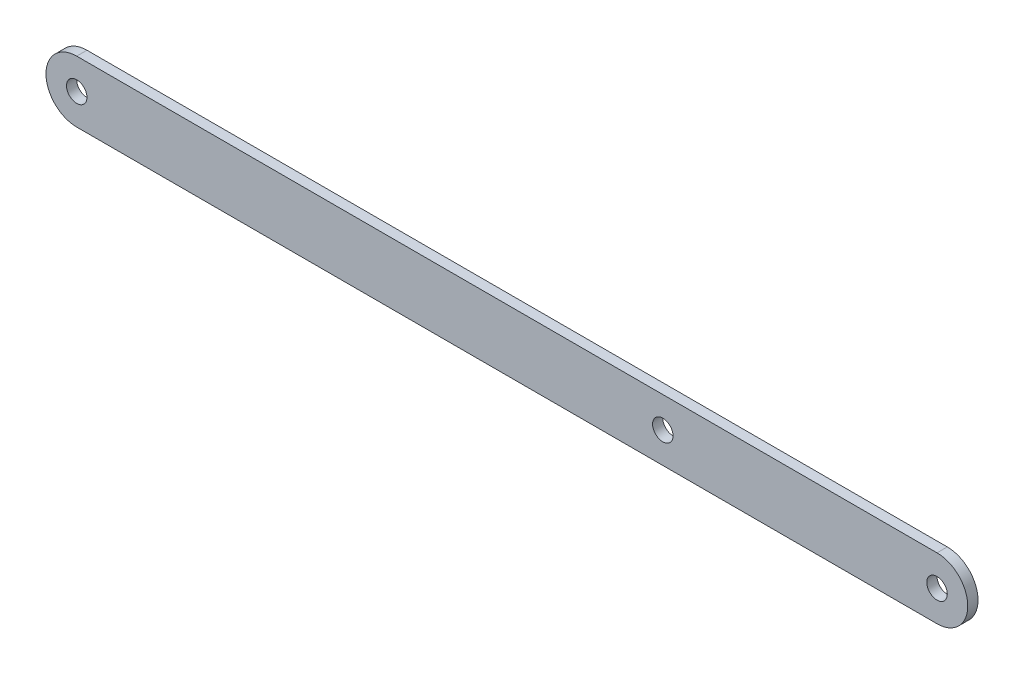
ISO-10303-21;
HEADER;
FILE_DESCRIPTION(('STEP AP214'),'2;1');
FILE_NAME('part.step','',(''),(''),'','','');
FILE_SCHEMA(('AUTOMOTIVE_DESIGN { 1 0 10303 214 1 1 1 1 }'));
ENDSEC;
DATA;
#1=APPLICATION_CONTEXT('core data for automotive mechanical design processes');
#2=APPLICATION_PROTOCOL_DEFINITION('international standard','automotive_design',2000,#1);
#3=PRODUCT_CONTEXT('',#1,'mechanical');
#4=PRODUCT('Part','Part','',(#3));
#5=PRODUCT_RELATED_PRODUCT_CATEGORY('part','',(#4));
#6=PRODUCT_DEFINITION_FORMATION('','',#4);
#7=PRODUCT_DEFINITION_CONTEXT('part definition',#1,'design');
#8=PRODUCT_DEFINITION('design','',#6,#7);
#9=PRODUCT_DEFINITION_SHAPE('','',#8);
#10=(LENGTH_UNIT() NAMED_UNIT(*) SI_UNIT(.MILLI.,.METRE.));
#11=(NAMED_UNIT(*) PLANE_ANGLE_UNIT() SI_UNIT($,.RADIAN.));
#12=(NAMED_UNIT(*) SI_UNIT($,.STERADIAN.) SOLID_ANGLE_UNIT());
#13=UNCERTAINTY_MEASURE_WITH_UNIT(LENGTH_MEASURE(1.E-05),#10,'distance_accuracy_value','');
#14=(GEOMETRIC_REPRESENTATION_CONTEXT(3) GLOBAL_UNCERTAINTY_ASSIGNED_CONTEXT((#13)) GLOBAL_UNIT_ASSIGNED_CONTEXT((#10,
#11,#12)) REPRESENTATION_CONTEXT('',''));
#15=CARTESIAN_POINT('',(0.,0.,0.));
#16=DIRECTION('',(0.,0.,1.));
#17=DIRECTION('',(1.,0.,0.));
#18=AXIS2_PLACEMENT_3D('',#15,#16,#17);
#19=CARTESIAN_POINT('',(0.,0.,12.7));
#20=DIRECTION('',(0.,0.,1.));
#21=DIRECTION('',(1.,0.,0.));
#22=AXIS2_PLACEMENT_3D('',#19,#20,#21);
#23=PLANE('',#22);
#24=CARTESIAN_POINT('',(726.772091624915,0.,12.7));
#25=DIRECTION('',(0.,0.,1.));
#26=DIRECTION('',(1.,0.,0.));
#27=AXIS2_PLACEMENT_3D('',#24,#25,#26);
#28=CIRCLE('',#27,12.7);
#29=CARTESIAN_POINT('',(739.472091624915,0.,12.7));
#30=VERTEX_POINT('',#29);
#31=EDGE_CURVE('E149',#30,#30,#28,.T.);
#32=ORIENTED_EDGE('',*,*,#31,.F.);
#33=EDGE_LOOP('',(#32));
#34=FACE_BOUND('',#33,.T.);
#35=CARTESIAN_POINT('',(0.,0.,12.7));
#36=DIRECTION('',(0.,0.,1.));
#37=DIRECTION('',(1.,0.,0.));
#38=AXIS2_PLACEMENT_3D('',#35,#36,#37);
#39=CIRCLE('',#38,12.7);
#40=CARTESIAN_POINT('',(12.7,0.,12.7));
#41=VERTEX_POINT('',#40);
#42=EDGE_CURVE('E115',#41,#41,#39,.T.);
#43=ORIENTED_EDGE('',*,*,#42,.F.);
#44=EDGE_LOOP('',(#43));
#45=FACE_BOUND('',#44,.T.);
#46=CARTESIAN_POINT('',(0.,0.,12.7));
#47=DIRECTION('',(0.,0.,1.));
#48=DIRECTION('',(1.,0.,0.));
#49=AXIS2_PLACEMENT_3D('',#46,#47,#48);
#50=CIRCLE('',#49,38.1);
#51=CARTESIAN_POINT('',(0.,38.1,12.7));
#52=VERTEX_POINT('',#51);
#53=CARTESIAN_POINT('',(0.,-38.1,12.7));
#54=VERTEX_POINT('',#53);
#55=EDGE_CURVE('E95',#52,#54,#50,.T.);
#56=ORIENTED_EDGE('',*,*,#55,.T.);
#57=DIRECTION('',(1.,0.,0.));
#58=VECTOR('',#57,1.);
#59=CARTESIAN_POINT('',(1066.8,-38.1000000000001,12.7));
#60=LINE('',#59,#58);
#61=CARTESIAN_POINT('',(1066.8,-38.1000000000001,12.7));
#62=VERTEX_POINT('',#61);
#63=EDGE_CURVE('E90',#54,#62,#60,.T.);
#64=ORIENTED_EDGE('',*,*,#63,.T.);
#65=CARTESIAN_POINT('',(1066.8,0.,12.7));
#66=DIRECTION('',(0.,0.,1.));
#67=DIRECTION('',(1.,0.,0.));
#68=AXIS2_PLACEMENT_3D('',#65,#66,#67);
#69=CIRCLE('',#68,38.1000000000001);
#70=CARTESIAN_POINT('',(1066.8,38.1000000000001,12.7));
#71=VERTEX_POINT('',#70);
#72=EDGE_CURVE('E93',#62,#71,#69,.T.);
#73=ORIENTED_EDGE('',*,*,#72,.T.);
#74=DIRECTION('',(-1.,0.,0.));
#75=VECTOR('',#74,1.);
#76=CARTESIAN_POINT('',(0.,38.1,12.7));
#77=LINE('',#76,#75);
#78=EDGE_CURVE('E60',#71,#52,#77,.T.);
#79=ORIENTED_EDGE('',*,*,#78,.T.);
#80=EDGE_LOOP('',(#56,#64,#73,#79));
#81=FACE_BOUND('',#80,.T.);
#82=CARTESIAN_POINT('',(1066.8,0.,12.7));
#83=DIRECTION('',(0.,0.,1.));
#84=DIRECTION('',(1.,0.,0.));
#85=AXIS2_PLACEMENT_3D('',#82,#83,#84);
#86=CIRCLE('',#85,12.6999999999999);
#87=CARTESIAN_POINT('',(1079.5,0.,12.7));
#88=VERTEX_POINT('',#87);
#89=EDGE_CURVE('E137',#88,#88,#86,.T.);
#90=ORIENTED_EDGE('',*,*,#89,.F.);
#91=EDGE_LOOP('',(#90));
#92=FACE_BOUND('',#91,.T.);
#93=ADVANCED_FACE('F42',(#34,#45,#81,#92),#23,.T.);
#94=CARTESIAN_POINT('',(0.,0.,0.));
#95=DIRECTION('',(0.,0.,1.));
#96=DIRECTION('',(1.,0.,0.));
#97=AXIS2_PLACEMENT_3D('',#94,#95,#96);
#98=PLANE('',#97);
#99=CARTESIAN_POINT('',(726.772091624915,0.,0.));
#100=DIRECTION('',(0.,0.,1.));
#101=DIRECTION('',(1.,0.,0.));
#102=AXIS2_PLACEMENT_3D('',#99,#100,#101);
#103=CIRCLE('',#102,12.7);
#104=CARTESIAN_POINT('',(739.472091624915,0.,0.));
#105=VERTEX_POINT('',#104);
#106=EDGE_CURVE('E145',#105,#105,#103,.T.);
#107=ORIENTED_EDGE('',*,*,#106,.T.);
#108=EDGE_LOOP('',(#107));
#109=FACE_BOUND('',#108,.T.);
#110=CARTESIAN_POINT('',(0.,0.,0.));
#111=DIRECTION('',(0.,0.,1.));
#112=DIRECTION('',(1.,0.,0.));
#113=AXIS2_PLACEMENT_3D('',#110,#111,#112);
#114=CIRCLE('',#113,38.1);
#115=CARTESIAN_POINT('',(0.,38.1,0.));
#116=VERTEX_POINT('',#115);
#117=CARTESIAN_POINT('',(0.,-38.1,0.));
#118=VERTEX_POINT('',#117);
#119=EDGE_CURVE('E111',#116,#118,#114,.T.);
#120=ORIENTED_EDGE('',*,*,#119,.F.);
#121=DIRECTION('',(-1.,0.,0.));
#122=VECTOR('',#121,1.);
#123=CARTESIAN_POINT('',(0.,38.1,0.));
#124=LINE('',#123,#122);
#125=CARTESIAN_POINT('',(1066.8,38.1000000000001,0.));
#126=VERTEX_POINT('',#125);
#127=EDGE_CURVE('E83',#126,#116,#124,.T.);
#128=ORIENTED_EDGE('',*,*,#127,.F.);
#129=CARTESIAN_POINT('',(1066.8,0.,0.));
#130=DIRECTION('',(0.,0.,1.));
#131=DIRECTION('',(1.,0.,0.));
#132=AXIS2_PLACEMENT_3D('',#129,#130,#131);
#133=CIRCLE('',#132,38.1000000000001);
#134=CARTESIAN_POINT('',(1066.8,-38.1000000000001,0.));
#135=VERTEX_POINT('',#134);
#136=EDGE_CURVE('E77',#135,#126,#133,.T.);
#137=ORIENTED_EDGE('',*,*,#136,.F.);
#138=DIRECTION('',(1.,0.,0.));
#139=VECTOR('',#138,1.);
#140=CARTESIAN_POINT('',(1066.8,-38.1000000000001,0.));
#141=LINE('',#140,#139);
#142=EDGE_CURVE('E100',#118,#135,#141,.T.);
#143=ORIENTED_EDGE('',*,*,#142,.F.);
#144=EDGE_LOOP('',(#120,#128,#137,#143));
#145=FACE_BOUND('',#144,.T.);
#146=CARTESIAN_POINT('',(0.,0.,0.));
#147=DIRECTION('',(0.,0.,1.));
#148=DIRECTION('',(1.,0.,0.));
#149=AXIS2_PLACEMENT_3D('',#146,#147,#148);
#150=CIRCLE('',#149,12.7);
#151=CARTESIAN_POINT('',(12.7,0.,0.));
#152=VERTEX_POINT('',#151);
#153=EDGE_CURVE('E133',#152,#152,#150,.T.);
#154=ORIENTED_EDGE('',*,*,#153,.T.);
#155=EDGE_LOOP('',(#154));
#156=FACE_BOUND('',#155,.T.);
#157=CARTESIAN_POINT('',(1066.8,0.,0.));
#158=DIRECTION('',(0.,0.,1.));
#159=DIRECTION('',(1.,0.,0.));
#160=AXIS2_PLACEMENT_3D('',#157,#158,#159);
#161=CIRCLE('',#160,12.6999999999999);
#162=CARTESIAN_POINT('',(1079.5,0.,0.));
#163=VERTEX_POINT('',#162);
#164=EDGE_CURVE('E141',#163,#163,#161,.T.);
#165=ORIENTED_EDGE('',*,*,#164,.T.);
#166=EDGE_LOOP('',(#165));
#167=FACE_BOUND('',#166,.T.);
#168=ADVANCED_FACE('F128',(#109,#145,#156,#167),#98,.F.);
#169=CARTESIAN_POINT('',(0.,0.,12.7));
#170=DIRECTION('',(0.,0.,-1.));
#171=DIRECTION('',(-1.,0.,0.));
#172=AXIS2_PLACEMENT_3D('',#169,#170,#171);
#173=CYLINDRICAL_SURFACE('',#172,38.1);
#174=ORIENTED_EDGE('',*,*,#119,.T.);
#175=DIRECTION('',(0.,0.,-1.));
#176=VECTOR('',#175,1.);
#177=CARTESIAN_POINT('',(0.,-38.1,12.7));
#178=LINE('',#177,#176);
#179=EDGE_CURVE('E11',#54,#118,#178,.T.);
#180=ORIENTED_EDGE('',*,*,#179,.F.);
#181=ORIENTED_EDGE('',*,*,#55,.F.);
#182=DIRECTION('',(0.,0.,-1.));
#183=VECTOR('',#182,1.);
#184=CARTESIAN_POINT('',(0.,38.1,12.7));
#185=LINE('',#184,#183);
#186=EDGE_CURVE('E107',#52,#116,#185,.T.);
#187=ORIENTED_EDGE('',*,*,#186,.T.);
#188=EDGE_LOOP('',(#174,#180,#181,#187));
#189=FACE_BOUND('',#188,.T.);
#190=ADVANCED_FACE('F44',(#189),#173,.T.);
#191=CARTESIAN_POINT('',(1066.8,-38.1000000000001,12.7));
#192=DIRECTION('',(0.,1.,0.));
#193=DIRECTION('',(-1.,0.,0.));
#194=AXIS2_PLACEMENT_3D('',#191,#192,#193);
#195=PLANE('',#194);
#196=ORIENTED_EDGE('',*,*,#142,.T.);
#197=DIRECTION('',(0.,0.,-1.));
#198=VECTOR('',#197,1.);
#199=CARTESIAN_POINT('',(1066.8,-38.1000000000001,12.7));
#200=LINE('',#199,#198);
#201=EDGE_CURVE('E52',#62,#135,#200,.T.);
#202=ORIENTED_EDGE('',*,*,#201,.F.);
#203=ORIENTED_EDGE('',*,*,#63,.F.);
#204=ORIENTED_EDGE('',*,*,#179,.T.);
#205=EDGE_LOOP('',(#196,#202,#203,#204));
#206=FACE_BOUND('',#205,.T.);
#207=ADVANCED_FACE('F99',(#206),#195,.F.);
#208=CARTESIAN_POINT('',(1066.8,0.,12.7));
#209=DIRECTION('',(0.,0.,-1.));
#210=DIRECTION('',(-1.,0.,0.));
#211=AXIS2_PLACEMENT_3D('',#208,#209,#210);
#212=CYLINDRICAL_SURFACE('',#211,38.1000000000001);
#213=ORIENTED_EDGE('',*,*,#136,.T.);
#214=DIRECTION('',(0.,0.,-1.));
#215=VECTOR('',#214,1.);
#216=CARTESIAN_POINT('',(1066.8,38.1000000000001,12.7));
#217=LINE('',#216,#215);
#218=EDGE_CURVE('E102',#71,#126,#217,.T.);
#219=ORIENTED_EDGE('',*,*,#218,.F.);
#220=ORIENTED_EDGE('',*,*,#72,.F.);
#221=ORIENTED_EDGE('',*,*,#201,.T.);
#222=EDGE_LOOP('',(#213,#219,#220,#221));
#223=FACE_BOUND('',#222,.T.);
#224=ADVANCED_FACE('F103',(#223),#212,.T.);
#225=CARTESIAN_POINT('',(0.,38.1,12.7));
#226=DIRECTION('',(0.,-1.,0.));
#227=DIRECTION('',(1.,0.,0.));
#228=AXIS2_PLACEMENT_3D('',#225,#226,#227);
#229=PLANE('',#228);
#230=ORIENTED_EDGE('',*,*,#127,.T.);
#231=ORIENTED_EDGE('',*,*,#186,.F.);
#232=ORIENTED_EDGE('',*,*,#78,.F.);
#233=ORIENTED_EDGE('',*,*,#218,.T.);
#234=EDGE_LOOP('',(#230,#231,#232,#233));
#235=FACE_BOUND('',#234,.T.);
#236=ADVANCED_FACE('F125',(#235),#229,.F.);
#237=CARTESIAN_POINT('',(0.,0.,12.7));
#238=DIRECTION('',(0.,0.,-1.));
#239=DIRECTION('',(-1.,0.,0.));
#240=AXIS2_PLACEMENT_3D('',#237,#238,#239);
#241=CYLINDRICAL_SURFACE('',#240,12.7);
#242=ORIENTED_EDGE('',*,*,#42,.T.);
#243=EDGE_LOOP('',(#242));
#244=FACE_BOUND('',#243,.T.);
#245=ORIENTED_EDGE('',*,*,#153,.F.);
#246=EDGE_LOOP('',(#245));
#247=FACE_BOUND('',#246,.T.);
#248=ADVANCED_FACE('F170',(#244,#247),#241,.F.);
#249=CARTESIAN_POINT('',(1066.8,0.,12.7));
#250=DIRECTION('',(0.,0.,-1.));
#251=DIRECTION('',(-1.,0.,0.));
#252=AXIS2_PLACEMENT_3D('',#249,#250,#251);
#253=CYLINDRICAL_SURFACE('',#252,12.6999999999999);
#254=ORIENTED_EDGE('',*,*,#89,.T.);
#255=EDGE_LOOP('',(#254));
#256=FACE_BOUND('',#255,.T.);
#257=ORIENTED_EDGE('',*,*,#164,.F.);
#258=EDGE_LOOP('',(#257));
#259=FACE_BOUND('',#258,.T.);
#260=ADVANCED_FACE('F161',(#256,#259),#253,.F.);
#261=CARTESIAN_POINT('',(726.772091624915,0.,0.));
#262=DIRECTION('',(0.,0.,1.));
#263=DIRECTION('',(1.,0.,0.));
#264=AXIS2_PLACEMENT_3D('',#261,#262,#263);
#265=CYLINDRICAL_SURFACE('',#264,12.7);
#266=ORIENTED_EDGE('',*,*,#106,.F.);
#267=EDGE_LOOP('',(#266));
#268=FACE_BOUND('',#267,.T.);
#269=ORIENTED_EDGE('',*,*,#31,.T.);
#270=EDGE_LOOP('',(#269));
#271=FACE_BOUND('',#270,.T.);
#272=ADVANCED_FACE('F158',(#268,#271),#265,.F.);
#273=CLOSED_SHELL('',(#93,#168,#190,#207,#224,#236,#248,#260,#272));
#274=MANIFOLD_SOLID_BREP('B2',#273);
#275=ADVANCED_BREP_SHAPE_REPRESENTATION('',(#18,#274),#14);
#276=SHAPE_DEFINITION_REPRESENTATION(#9,#275);
ENDSEC;
END-ISO-10303-21;
